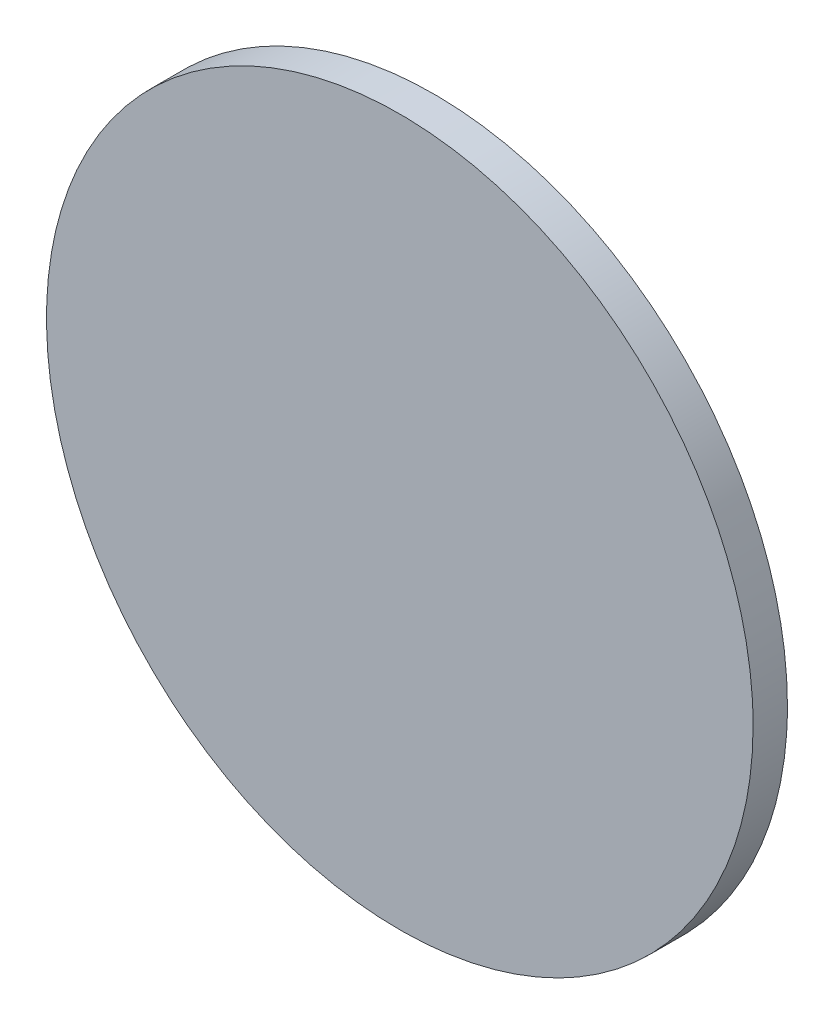
ISO-10303-21;
HEADER;
FILE_DESCRIPTION(('STEP AP214'),'2;1');
FILE_NAME('part.step','',(''),(''),'','','');
FILE_SCHEMA(('AUTOMOTIVE_DESIGN { 1 0 10303 214 1 1 1 1 }'));
ENDSEC;
DATA;
#1=APPLICATION_CONTEXT('core data for automotive mechanical design processes');
#2=APPLICATION_PROTOCOL_DEFINITION('international standard','automotive_design',2000,#1);
#3=PRODUCT_CONTEXT('',#1,'mechanical');
#4=PRODUCT('Part','Part','',(#3));
#5=PRODUCT_RELATED_PRODUCT_CATEGORY('part','',(#4));
#6=PRODUCT_DEFINITION_FORMATION('','',#4);
#7=PRODUCT_DEFINITION_CONTEXT('part definition',#1,'design');
#8=PRODUCT_DEFINITION('design','',#6,#7);
#9=PRODUCT_DEFINITION_SHAPE('','',#8);
#10=(LENGTH_UNIT() NAMED_UNIT(*) SI_UNIT(.MILLI.,.METRE.));
#11=(NAMED_UNIT(*) PLANE_ANGLE_UNIT() SI_UNIT($,.RADIAN.));
#12=(NAMED_UNIT(*) SI_UNIT($,.STERADIAN.) SOLID_ANGLE_UNIT());
#13=UNCERTAINTY_MEASURE_WITH_UNIT(LENGTH_MEASURE(1.E-05),#10,'distance_accuracy_value','');
#14=(GEOMETRIC_REPRESENTATION_CONTEXT(3) GLOBAL_UNCERTAINTY_ASSIGNED_CONTEXT((#13)) GLOBAL_UNIT_ASSIGNED_CONTEXT((#10,
#11,#12)) REPRESENTATION_CONTEXT('',''));
#15=CARTESIAN_POINT('',(0.,0.,0.));
#16=DIRECTION('',(0.,0.,1.));
#17=DIRECTION('',(1.,0.,0.));
#18=AXIS2_PLACEMENT_3D('',#15,#16,#17);
#19=CARTESIAN_POINT('',(148.667047186081,51.5235974877803,10098.6340137882));
#20=CARTESIAN_POINT('',(148.667047186081,48.1585468177496,10098.6340137882));
#21=CARTESIAN_POINT('',(148.336418508615,41.428445477688,10098.6340137882));
#22=CARTESIAN_POINT('',(146.853365662372,31.4305153000243,10098.6340137882));
#23=CARTESIAN_POINT('',(144.397485595714,21.6260924878247,10098.6340137882));
#24=CARTESIAN_POINT('',(140.992429776203,12.1095989924134,10098.6340137882));
#25=CARTESIAN_POINT('',(136.670990752775,2.97268384839567,10098.6340137882));
#26=CARTESIAN_POINT('',(131.474786345563,-5.6966594566456,10098.6340137882));
#27=CARTESIAN_POINT('',(125.453858843544,-13.8149404075378,10098.6340137882));
#28=CARTESIAN_POINT('',(118.666193069936,-21.3039755208201,10098.6340137882));
#29=CARTESIAN_POINT('',(111.177157956653,-28.0916412944284,10098.6340137882));
#30=CARTESIAN_POINT('',(103.058877005761,-34.1125687964475,10098.6340137882));
#31=CARTESIAN_POINT('',(94.3895337007198,-39.308773203659,10098.6340137882));
#32=CARTESIAN_POINT('',(85.2526185567022,-43.6302122270874,10098.6340137882));
#33=CARTESIAN_POINT('',(75.7361250612908,-47.035268046598,10098.6340137882));
#34=CARTESIAN_POINT('',(65.9317022490913,-49.4911481132562,10098.6340137882));
#35=CARTESIAN_POINT('',(55.9337720714275,-50.9742009594993,10098.6340137882));
#36=CARTESIAN_POINT('',(45.8386200613352,-51.4701439756991,10098.6340137882));
#37=CARTESIAN_POINT('',(35.7434680512428,-50.9742009594994,10098.6340137882));
#38=CARTESIAN_POINT('',(25.7455378735791,-49.4911481132562,10098.6340137882));
#39=CARTESIAN_POINT('',(15.9411150613795,-47.035268046598,10098.6340137882));
#40=CARTESIAN_POINT('',(6.42462156596818,-43.6302122270873,10098.6340137882));
#41=CARTESIAN_POINT('',(-2.71229357804946,-39.3087732036591,10098.6340137882));
#42=CARTESIAN_POINT('',(-11.3816368830908,-34.1125687964475,10098.6340137882));
#43=CARTESIAN_POINT('',(-19.499917833983,-28.0916412944284,10098.6340137882));
#44=CARTESIAN_POINT('',(-26.9889529472652,-21.3039755208201,10098.6340137882));
#45=CARTESIAN_POINT('',(-33.7766187208736,-13.8149404075378,10098.6340137882));
#46=CARTESIAN_POINT('',(-39.7975462228927,-5.6966594566456,10098.6340137882));
#47=CARTESIAN_POINT('',(-44.9937506301042,2.97268384839566,10098.6340137882));
#48=CARTESIAN_POINT('',(-49.3151896535325,12.1095989924133,10098.6340137882));
#49=CARTESIAN_POINT('',(-52.7202454730432,21.6260924878247,10098.6340137882));
#50=CARTESIAN_POINT('',(-55.1761255397013,31.4305153000242,10098.6340137882));
#51=CARTESIAN_POINT('',(-56.6591783859445,41.428445477688,10098.6340137882));
#52=CARTESIAN_POINT('',(-57.1551214021443,51.5235974877803,10098.6340137882));
#53=CARTESIAN_POINT('',(-56.6591783859445,61.6187494978727,10098.6340137882));
#54=CARTESIAN_POINT('',(-55.1761255397013,71.6166796755364,10098.6340137882));
#55=CARTESIAN_POINT('',(-52.7202454730431,81.421102487736,10098.6340137882));
#56=CARTESIAN_POINT('',(-49.3151896535326,90.9375959831473,10098.6340137882));
#57=CARTESIAN_POINT('',(-44.9937506301042,100.074511127165,10098.6340137882));
#58=CARTESIAN_POINT('',(-39.7975462228927,108.743854432206,10098.6340137882));
#59=CARTESIAN_POINT('',(-33.7766187208736,116.862135383098,10098.6340137882));
#60=CARTESIAN_POINT('',(-26.9889529472652,124.351170496381,10098.6340137882));
#61=CARTESIAN_POINT('',(-19.499917833983,131.138836269989,10098.6340137882));
#62=CARTESIAN_POINT('',(-11.3816368830907,137.159763772008,10098.6340137882));
#63=CARTESIAN_POINT('',(-2.7122935780495,142.35596817922,10098.6340137882));
#64=CARTESIAN_POINT('',(6.42462156596814,146.677407202648,10098.6340137882));
#65=CARTESIAN_POINT('',(15.9411150613794,150.082463022159,10098.6340137882));
#66=CARTESIAN_POINT('',(25.745537873579,152.538343088817,10098.6340137882));
#67=CARTESIAN_POINT('',(35.7434680512428,154.02139593506,10098.6340137882));
#68=CARTESIAN_POINT('',(45.8386200613352,154.51733895126,10098.6340137882));
#69=CARTESIAN_POINT('',(55.9337720714275,154.02139593506,10098.6340137882));
#70=CARTESIAN_POINT('',(65.9317022490913,152.538343088817,10098.6340137882));
#71=CARTESIAN_POINT('',(75.7361250612908,150.082463022159,10098.6340137882));
#72=CARTESIAN_POINT('',(85.2526185567022,146.677407202648,10098.6340137882));
#73=CARTESIAN_POINT('',(94.3895337007198,142.35596817922,10098.6340137882));
#74=CARTESIAN_POINT('',(103.058877005761,137.159763772008,10098.6340137882));
#75=CARTESIAN_POINT('',(111.177157956653,131.138836269989,10098.6340137882));
#76=CARTESIAN_POINT('',(118.666193069936,124.351170496381,10098.6340137882));
#77=CARTESIAN_POINT('',(125.453858843544,116.862135383099,10098.6340137882));
#78=CARTESIAN_POINT('',(131.474786345563,108.743854432206,10098.6340137882));
#79=CARTESIAN_POINT('',(136.670990752775,100.074511127165,10098.6340137882));
#80=CARTESIAN_POINT('',(140.992429776203,90.9375959831474,10098.6340137882));
#81=CARTESIAN_POINT('',(144.397485595714,81.421102487736,10098.6340137882));
#82=CARTESIAN_POINT('',(146.853365662372,71.6166796755365,10098.6340137882));
#83=CARTESIAN_POINT('',(148.336418508615,61.6187494978726,10098.6340137882));
#84=CARTESIAN_POINT('',(148.667047186081,54.8886481578111,10098.6340137882));
#85=CARTESIAN_POINT('',(148.667047186081,51.5235974877803,10098.6340137882));
#86=B_SPLINE_CURVE_WITH_KNOTS('',3,(#19,#20,#21,#22,#23,#24,#25,#26,#27,#28,#29,#30,#31,#32,#33,
#34,#35,#36,#37,#38,#39,#40,#41,#42,#43,#44,#45,#46,#47,#48,#49,#50,#51,#52,#53,#54,#55,#56,#57,
#58,#59,#60,#61,#62,#63,#64,#65,#66,#67,#68,#69,#70,#71,#72,#73,#74,#75,#76,#77,#78,#79,#80,#81,
#82,#83,#84,#85),.UNSPECIFIED.,.T.,.F.,(4,1,1,1,1,1,1,1,1,1,1,1,1,1,1,1,1,1,1,1,1,1,1,1,1,1,1,1,
1,1,1,1,1,1,1,1,1,1,1,1,1,1,1,1,1,1,1,1,1,1,1,1,1,1,1,1,1,1,1,1,1,1,1,1,4),(0.,0.015625,0.03125,
0.046875,0.0625000000000001,0.0781250000000001,0.0937500000000001,0.109375,0.125,0.140625,
0.15625,0.171875,0.1875,0.203125,0.21875,0.234375,0.25,0.265625,0.28125,0.296875,0.3125,
0.328125,0.34375,0.359375,0.375,0.390625,0.40625,0.421875,0.4375,0.453125,0.46875,0.484375,0.5,
0.515625,0.53125,0.546875,0.5625,0.578125,0.59375,0.609375,0.625,0.640625,0.65625,0.671875,
0.6875,0.703125,0.71875,0.734375,0.75,0.765625,0.78125,0.796875,0.8125,0.828125,0.84375,
0.859375,0.875,0.890625,0.90625,0.921875,0.9375,0.953125,0.96875,0.984375,1.),.UNSPECIFIED.);
#87=DIRECTION('',(0.,0.,1.));
#88=VECTOR('',#87,1.);
#89=SURFACE_OF_LINEAR_EXTRUSION('',#86,#88);
#90=CARTESIAN_POINT('',(148.667047186081,51.5235974877803,10098.6340137882));
#91=CARTESIAN_POINT('',(148.667047186081,53.2061228227957,10098.6340137882));
#92=CARTESIAN_POINT('',(148.625718601398,54.8886481578111,10098.6340137882));
#93=CARTESIAN_POINT('',(148.460603271096,58.2496479181574,10098.6340137882));
#94=CARTESIAN_POINT('',(148.336816525478,59.9281223434882,10098.6340137882));
#95=CARTESIAN_POINT('',(148.006983881737,63.2769693747809,10098.6340137882));
#96=CARTESIAN_POINT('',(147.800937983615,64.9473419807427,10098.6340137882));
#97=CARTESIAN_POINT('',(147.307182143602,68.2759734760875,10098.6340137882));
#98=CARTESIAN_POINT('',(147.019472201711,69.9342323654705,10098.6340137882));
#99=CARTESIAN_POINT('',(146.362983382894,73.2346245304477,10098.6340137882));
#100=CARTESIAN_POINT('',(145.994204505968,74.876757806042,10098.6340137882));
#101=CARTESIAN_POINT('',(145.176563294897,78.14096449547,10098.6340137882));
#102=CARTESIAN_POINT('',(144.727700960752,79.7630379093037,10098.6340137882));
#103=CARTESIAN_POINT('',(143.750878313057,82.9831906272389,10098.6340137882));
#104=CARTESIAN_POINT('',(143.222917999508,84.5812699313403,10098.6340137882));
#105=CARTESIAN_POINT('',(142.08926574921,87.7496157200355,10098.6340137882));
#106=CARTESIAN_POINT('',(141.483573812461,89.3198822046294,10098.6340137882));
#107=CARTESIAN_POINT('',(140.195824671972,92.4287836445342,10098.6340137882));
#108=CARTESIAN_POINT('',(139.51376746823,93.9674185998452,10098.6340137882));
#109=CARTESIAN_POINT('',(138.075021869593,97.0093905858685,10098.6340137882));
#110=CARTESIAN_POINT('',(137.318333474697,98.5127276165807,10098.6340137882));
#111=CARTESIAN_POINT('',(135.732059569591,101.480437358091,10098.6340137882));
#112=CARTESIAN_POINT('',(134.90247405938,102.944810068888,10098.6340137882));
#113=CARTESIAN_POINT('',(133.172491019017,105.831112399103,10098.6340137882));
#114=CARTESIAN_POINT('',(132.272093488864,107.25304201852,10098.6340137882));
#115=CARTESIAN_POINT('',(130.402571503992,110.050979394509,10098.6340137882));
#116=CARTESIAN_POINT('',(129.433447049273,111.426987151081,10098.6340137882));
#117=CARTESIAN_POINT('',(127.428887249567,114.129823156234,10098.6340137882));
#118=CARTESIAN_POINT('',(126.393451904581,115.456651404816,10098.6340137882));
#119=CARTESIAN_POINT('',(124.258686358643,118.057870748845,10098.6340137882));
#120=CARTESIAN_POINT('',(123.159356157692,119.332261844292,10098.6340137882));
#121=CARTESIAN_POINT('',(120.899524605319,121.825601736134,10098.6340137882));
#122=CARTESIAN_POINT('',(119.739023253897,123.044550532528,10098.6340137882));
#123=CARTESIAN_POINT('',(117.359573106082,125.424000680343,10098.6340137882));
#124=CARTESIAN_POINT('',(116.140624309688,126.584502031764,10098.6340137882));
#125=CARTESIAN_POINT('',(113.647284417847,128.844333584137,10098.6340137882));
#126=CARTESIAN_POINT('',(112.372893322399,129.943663785089,10098.6340137882));
#127=CARTESIAN_POINT('',(109.77167397837,132.078429331027,10098.6340137882));
#128=CARTESIAN_POINT('',(108.444845729789,133.113864676013,10098.6340137882));
#129=CARTESIAN_POINT('',(105.742009724636,135.118424475718,10098.6340137882));
#130=CARTESIAN_POINT('',(104.366001968064,136.087548930438,10098.6340137882));
#131=CARTESIAN_POINT('',(101.568064592075,137.95707091531,10098.6340137882));
#132=CARTESIAN_POINT('',(100.146134972658,138.857468445462,10098.6340137882));
#133=CARTESIAN_POINT('',(97.2598326424428,140.587451485825,10098.6340137882));
#134=CARTESIAN_POINT('',(95.7954599316452,141.417036996036,10098.6340137882));
#135=CARTESIAN_POINT('',(92.8277501901354,143.003310901143,10098.6340137882));
#136=CARTESIAN_POINT('',(91.3244131594231,143.759999296038,10098.6340137882));
#137=CARTESIAN_POINT('',(88.2824411733998,145.198744894675,10098.6340137882));
#138=CARTESIAN_POINT('',(86.7438062180888,145.880802098417,10098.6340137882));
#139=CARTESIAN_POINT('',(83.634904778184,147.168551238907,10098.6340137882));
#140=CARTESIAN_POINT('',(82.0646382935901,147.774243175655,10098.6340137882));
#141=CARTESIAN_POINT('',(78.8962925048949,148.907895425953,10098.6340137882));
#142=CARTESIAN_POINT('',(77.2982132007935,149.435855739503,10098.6340137882));
#143=CARTESIAN_POINT('',(74.0780604828583,150.412678387197,10098.6340137882));
#144=CARTESIAN_POINT('',(72.4559870690246,150.861540721343,10098.6340137882));
#145=CARTESIAN_POINT('',(69.1917803795966,151.679181932414,10098.6340137882));
#146=CARTESIAN_POINT('',(67.5496471040023,152.047960809339,10098.6340137882));
#147=CARTESIAN_POINT('',(64.2492549390251,152.704449628156,10098.6340137882));
#148=CARTESIAN_POINT('',(62.5909960496421,152.992159570047,10098.6340137882));
#149=CARTESIAN_POINT('',(59.2623645542974,153.48591541006,10098.6340137882));
#150=CARTESIAN_POINT('',(57.5919919483356,153.691961308183,10098.6340137882));
#151=CARTESIAN_POINT('',(54.2431449170429,154.021793951923,10098.6340137882));
#152=CARTESIAN_POINT('',(52.564670491712,154.145580697541,10098.6340137882));
#153=CARTESIAN_POINT('',(49.2036707313658,154.310696027843,10098.6340137882));
#154=CARTESIAN_POINT('',(47.5211453963504,154.352024612527,10098.6340137882));
#155=CARTESIAN_POINT('',(44.1560947263196,154.352024612527,10098.6340137882));
#156=CARTESIAN_POINT('',(42.4735693913042,154.310696027843,10098.6340137882));
#157=CARTESIAN_POINT('',(39.112569630958,154.145580697541,10098.6340137882));
#158=CARTESIAN_POINT('',(37.4340952056271,154.021793951923,10098.6340137882));
#159=CARTESIAN_POINT('',(34.0852481743344,153.691961308183,10098.6340137882));
#160=CARTESIAN_POINT('',(32.4148755683726,153.48591541006,10098.6340137882));
#161=CARTESIAN_POINT('',(29.0862440730278,152.992159570047,10098.6340137882));
#162=CARTESIAN_POINT('',(27.4279851836448,152.704449628156,10098.6340137882));
#163=CARTESIAN_POINT('',(24.1275930186676,152.047960809339,10098.6340137882));
#164=CARTESIAN_POINT('',(22.4854597430733,151.679181932413,10098.6340137882));
#165=CARTESIAN_POINT('',(19.2212530536453,150.861540721342,10098.6340137882));
#166=CARTESIAN_POINT('',(17.5991796398116,150.412678387197,10098.6340137882));
#167=CARTESIAN_POINT('',(14.3790269218764,149.435855739502,10098.6340137882));
#168=CARTESIAN_POINT('',(12.780947617775,148.907895425953,10098.6340137882));
#169=CARTESIAN_POINT('',(9.61260182907983,147.774243175655,10098.6340137882));
#170=CARTESIAN_POINT('',(8.04233534448603,147.168551238907,10098.6340137882));
#171=CARTESIAN_POINT('',(4.93343390458121,145.880802098417,10098.6340137882));
#172=CARTESIAN_POINT('',(3.3947989492702,145.198744894675,10098.6340137882));
#173=CARTESIAN_POINT('',(0.352826963246936,143.759999296038,10098.6340137882));
#174=CARTESIAN_POINT('',(-1.15051006746532,143.003310901142,10098.6340137882));
#175=CARTESIAN_POINT('',(-4.11821980897513,141.417036996036,10098.6340137882));
#176=CARTESIAN_POINT('',(-5.58259251977269,140.587451485825,10098.6340137882));
#177=CARTESIAN_POINT('',(-8.46889484998758,138.857468445462,10098.6340137882));
#178=CARTESIAN_POINT('',(-9.89082446940491,137.957070915309,10098.6340137882));
#179=CARTESIAN_POINT('',(-12.6887618453938,136.087548930438,10098.6340137882));
#180=CARTESIAN_POINT('',(-14.0647696019654,135.118424475718,10098.6340137882));
#181=CARTESIAN_POINT('',(-16.7676056071186,133.113864676012,10098.6340137882));
#182=CARTESIAN_POINT('',(-18.0944338557002,132.078429331026,10098.6340137882));
#183=CARTESIAN_POINT('',(-20.6956531997293,129.943663785088,10098.6340137882));
#184=CARTESIAN_POINT('',(-21.9700442951768,128.844333584137,10098.6340137882));
#185=CARTESIAN_POINT('',(-24.4633841870182,126.584502031764,10098.6340137882));
#186=CARTESIAN_POINT('',(-25.6823329834121,125.424000680343,10098.6340137882));
#187=CARTESIAN_POINT('',(-28.0617831312272,123.044550532527,10098.6340137882));
#188=CARTESIAN_POINT('',(-29.2222844826484,121.825601736133,10098.6340137882));
#189=CARTESIAN_POINT('',(-31.4821160350214,119.332261844292,10098.6340137882));
#190=CARTESIAN_POINT('',(-32.5814462359732,118.057870748845,10098.6340137882));
#191=CARTESIAN_POINT('',(-34.7162117819111,115.456651404815,10098.6340137882));
#192=CARTESIAN_POINT('',(-35.7516471268971,114.129823156234,10098.6340137882));
#193=CARTESIAN_POINT('',(-37.7562069266027,111.426987151081,10098.6340137882));
#194=CARTESIAN_POINT('',(-38.7253313813223,110.050979394509,10098.6340137882));
#195=CARTESIAN_POINT('',(-40.5948533661941,107.25304201852,10098.6340137882));
#196=CARTESIAN_POINT('',(-41.4952508963463,105.831112399103,10098.6340137882));
#197=CARTESIAN_POINT('',(-43.2252339367095,102.944810068888,10098.6340137882));
#198=CARTESIAN_POINT('',(-44.0548194469204,101.48043735809,10098.6340137882));
#199=CARTESIAN_POINT('',(-45.6410933520271,98.5127276165805,10098.6340137882));
#200=CARTESIAN_POINT('',(-46.3977817469228,97.0093905858683,10098.6340137882));
#201=CARTESIAN_POINT('',(-47.8365273455599,93.967418599845,10098.6340137882));
#202=CARTESIAN_POINT('',(-48.5185845493014,92.428783644534,10098.6340137882));
#203=CARTESIAN_POINT('',(-49.8063336897912,89.3198822046292,10098.6340137882));
#204=CARTESIAN_POINT('',(-50.4120256265396,87.7496157200353,10098.6340137882));
#205=CARTESIAN_POINT('',(-51.5456778768375,84.5812699313401,10098.6340137882));
#206=CARTESIAN_POINT('',(-52.0736381903871,82.9831906272387,10098.6340137882));
#207=CARTESIAN_POINT('',(-53.0504608380819,79.7630379093036,10098.6340137882));
#208=CARTESIAN_POINT('',(-53.4993231722271,78.1409644954698,10098.6340137882));
#209=CARTESIAN_POINT('',(-54.316964383298,74.8767578060418,10098.6340137882));
#210=CARTESIAN_POINT('',(-54.6857432602238,73.2346245304475,10098.6340137882));
#211=CARTESIAN_POINT('',(-55.3422320790406,69.9342323654703,10098.6340137882));
#212=CARTESIAN_POINT('',(-55.6299420209318,68.2759734760874,10098.6340137882));
#213=CARTESIAN_POINT('',(-56.123697860945,64.9473419807426,10098.6340137882));
#214=CARTESIAN_POINT('',(-56.329743759067,63.2769693747808,10098.6340137882));
#215=CARTESIAN_POINT('',(-56.6595764028075,59.9281223434881,10098.6340137882));
#216=CARTESIAN_POINT('',(-56.783363148426,58.2496479181572,10098.6340137882));
#217=CARTESIAN_POINT('',(-56.9484784787277,54.888648157811,10098.6340137882));
#218=CARTESIAN_POINT('',(-56.989807063411,53.2061228227956,10098.6340137882));
#219=CARTESIAN_POINT('',(-56.989807063411,49.8410721527648,10098.6340137882));
#220=CARTESIAN_POINT('',(-56.9484784787277,48.1585468177494,10098.6340137882));
#221=CARTESIAN_POINT('',(-56.7833631484259,44.7975470574031,10098.6340137882));
#222=CARTESIAN_POINT('',(-56.6595764028075,43.1190726320723,10098.6340137882));
#223=CARTESIAN_POINT('',(-56.329743759067,39.7702256007796,10098.6340137882));
#224=CARTESIAN_POINT('',(-56.1236978609449,38.0998529948178,10098.6340137882));
#225=CARTESIAN_POINT('',(-55.6299420209317,34.771221499473,10098.6340137882));
#226=CARTESIAN_POINT('',(-55.3422320790406,33.1129626100901,10098.6340137882));
#227=CARTESIAN_POINT('',(-54.6857432602237,29.8125704451129,10098.6340137882));
#228=CARTESIAN_POINT('',(-54.3169643832979,28.1704371695186,10098.6340137882));
#229=CARTESIAN_POINT('',(-53.499323172227,24.9062304800906,10098.6340137882));
#230=CARTESIAN_POINT('',(-53.0504608380818,23.2841570662568,10098.6340137882));
#231=CARTESIAN_POINT('',(-52.073638190387,20.0640043483217,10098.6340137882));
#232=CARTESIAN_POINT('',(-51.5456778768374,18.4659250442203,10098.6340137882));
#233=CARTESIAN_POINT('',(-50.4120256265394,15.297579255525,10098.6340137882));
#234=CARTESIAN_POINT('',(-49.8063336897911,13.7273127709312,10098.6340137882));
#235=CARTESIAN_POINT('',(-48.5185845493013,10.6184113310264,10098.6340137882));
#236=CARTESIAN_POINT('',(-47.8365273455598,9.07977637571536,10098.6340137882));
#237=CARTESIAN_POINT('',(-46.3977817469226,6.03780438969208,10098.6340137882));
#238=CARTESIAN_POINT('',(-45.6410933520269,4.53446735897982,10098.6340137882));
#239=CARTESIAN_POINT('',(-44.0548194469203,1.56675761747,10098.6340137882));
#240=CARTESIAN_POINT('',(-43.2252339367093,0.102384906672438,10098.6340137882));
#241=CARTESIAN_POINT('',(-41.4952508963461,-2.78391742354245,10098.6340137882));
#242=CARTESIAN_POINT('',(-40.5948533661939,-4.20584704295978,10098.6340137882));
#243=CARTESIAN_POINT('',(-38.7253313813221,-7.00378441894869,10098.6340137882));
#244=CARTESIAN_POINT('',(-37.7562069266025,-8.37979217552027,10098.6340137882));
#245=CARTESIAN_POINT('',(-35.7516471268969,-11.0826281806735,10098.6340137882));
#246=CARTESIAN_POINT('',(-34.7162117819109,-12.4094564292551,10098.6340137882));
#247=CARTESIAN_POINT('',(-32.581446235973,-15.0106757732842,10098.6340137882));
#248=CARTESIAN_POINT('',(-31.4821160350211,-16.2850668687316,10098.6340137882));
#249=CARTESIAN_POINT('',(-29.2222844826481,-18.778406760573,10098.6340137882));
#250=CARTESIAN_POINT('',(-28.061783131227,-19.997355556967,10098.6340137882));
#251=CARTESIAN_POINT('',(-25.6823329834119,-22.3768057047821,10098.6340137882));
#252=CARTESIAN_POINT('',(-24.4633841870179,-23.5373070562032,10098.6340137882));
#253=CARTESIAN_POINT('',(-21.9700442951765,-25.7971386085762,10098.6340137882));
#254=CARTESIAN_POINT('',(-20.6956531997291,-26.896468809528,10098.6340137882));
#255=CARTESIAN_POINT('',(-18.0944338557,-29.0312343554659,10098.6340137882));
#256=CARTESIAN_POINT('',(-16.7676056071184,-30.066669700452,10098.6340137882));
#257=CARTESIAN_POINT('',(-14.0647696019652,-32.0712295001576,10098.6340137882));
#258=CARTESIAN_POINT('',(-12.6887618453936,-33.0403539548771,10098.6340137882));
#259=CARTESIAN_POINT('',(-9.89082446940467,-34.9098759397489,10098.6340137882));
#260=CARTESIAN_POINT('',(-8.46889484998733,-35.8102734699011,10098.6340137882));
#261=CARTESIAN_POINT('',(-5.58259251977243,-37.5402565102643,10098.6340137882));
#262=CARTESIAN_POINT('',(-4.11821980897487,-38.3698420204752,10098.6340137882));
#263=CARTESIAN_POINT('',(-1.15051006746505,-39.9561159255819,10098.6340137882));
#264=CARTESIAN_POINT('',(0.352826963247215,-40.7128043204776,10098.6340137882));
#265=CARTESIAN_POINT('',(3.39479894927049,-42.1515499191147,10098.6340137882));
#266=CARTESIAN_POINT('',(4.9334339045815,-42.8336071228562,10098.6340137882));
#267=CARTESIAN_POINT('',(8.04233534448633,-44.121356263346,10098.6340137882));
#268=CARTESIAN_POINT('',(9.61260182908015,-44.7270482000944,10098.6340137882));
#269=CARTESIAN_POINT('',(12.7809476177754,-45.8607004503923,10098.6340137882));
#270=CARTESIAN_POINT('',(14.3790269218768,-46.3886607639419,10098.6340137882));
#271=CARTESIAN_POINT('',(17.5991796398119,-47.3654834116367,10098.6340137882));
#272=CARTESIAN_POINT('',(19.2212530536457,-47.8143457457819,10098.6340137882));
#273=CARTESIAN_POINT('',(22.4854597430737,-48.6319869568528,10098.6340137882));
#274=CARTESIAN_POINT('',(24.127593018668,-49.0007658337786,10098.6340137882));
#275=CARTESIAN_POINT('',(27.4279851836452,-49.6572546525955,10098.6340137882));
#276=CARTESIAN_POINT('',(29.0862440730281,-49.9449645944866,10098.6340137882));
#277=CARTESIAN_POINT('',(32.4148755683729,-50.4387204344998,10098.6340137882));
#278=CARTESIAN_POINT('',(34.0852481743347,-50.6447663326219,10098.6340137882));
#279=CARTESIAN_POINT('',(37.4340952056274,-50.9745989763624,10098.6340137882));
#280=CARTESIAN_POINT('',(39.1125696309583,-51.0983857219808,10098.6340137882));
#281=CARTESIAN_POINT('',(42.4735693913045,-51.2635010522825,10098.6340137882));
#282=CARTESIAN_POINT('',(44.1560947263199,-51.3048296369659,10098.6340137882));
#283=CARTESIAN_POINT('',(47.5211453963507,-51.3048296369659,10098.6340137882));
#284=CARTESIAN_POINT('',(49.2036707313661,-51.2635010522825,10098.6340137882));
#285=CARTESIAN_POINT('',(52.5646704917123,-51.0983857219808,10098.6340137882));
#286=CARTESIAN_POINT('',(54.2431449170432,-50.9745989763624,10098.6340137882));
#287=CARTESIAN_POINT('',(57.5919919483359,-50.6447663326219,10098.6340137882));
#288=CARTESIAN_POINT('',(59.2623645542977,-50.4387204344998,10098.6340137882));
#289=CARTESIAN_POINT('',(62.5909960496424,-49.9449645944866,10098.6340137882));
#290=CARTESIAN_POINT('',(64.2492549390254,-49.6572546525954,10098.6340137882));
#291=CARTESIAN_POINT('',(67.5496471040026,-49.0007658337785,10098.6340137882));
#292=CARTESIAN_POINT('',(69.1917803795969,-48.6319869568528,10098.6340137882));
#293=CARTESIAN_POINT('',(72.4559870690249,-47.8143457457818,10098.6340137882));
#294=CARTESIAN_POINT('',(74.0780604828586,-47.3654834116366,10098.6340137882));
#295=CARTESIAN_POINT('',(77.2982132007938,-46.3886607639418,10098.6340137882));
#296=CARTESIAN_POINT('',(78.8962925048952,-45.8607004503923,10098.6340137882));
#297=CARTESIAN_POINT('',(82.0646382935904,-44.7270482000943,10098.6340137882));
#298=CARTESIAN_POINT('',(83.6349047781842,-44.121356263346,10098.6340137882));
#299=CARTESIAN_POINT('',(86.743806218089,-42.8336071228561,10098.6340137882));
#300=CARTESIAN_POINT('',(88.2824411734,-42.1515499191147,10098.6340137882));
#301=CARTESIAN_POINT('',(91.3244131594233,-40.7128043204775,10098.6340137882));
#302=CARTESIAN_POINT('',(92.8277501901356,-39.9561159255818,10098.6340137882));
#303=CARTESIAN_POINT('',(95.7954599316454,-38.3698420204751,10098.6340137882));
#304=CARTESIAN_POINT('',(97.259832642443,-37.5402565102642,10098.6340137882));
#305=CARTESIAN_POINT('',(100.146134972658,-35.810273469901,10098.6340137882));
#306=CARTESIAN_POINT('',(101.568064592075,-34.9098759397488,10098.6340137882));
#307=CARTESIAN_POINT('',(104.366001968064,-33.040353954877,10098.6340137882));
#308=CARTESIAN_POINT('',(105.742009724636,-32.0712295001575,10098.6340137882));
#309=CARTESIAN_POINT('',(108.444845729789,-30.0666697004518,10098.6340137882));
#310=CARTESIAN_POINT('',(109.771673978371,-29.0312343554658,10098.6340137882));
#311=CARTESIAN_POINT('',(112.3728933224,-26.8964688095279,10098.6340137882));
#312=CARTESIAN_POINT('',(113.647284417847,-25.797138608576,10098.6340137882));
#313=CARTESIAN_POINT('',(116.140624309688,-23.5373070562031,10098.6340137882));
#314=CARTESIAN_POINT('',(117.359573106082,-22.3768057047819,10098.6340137882));
#315=CARTESIAN_POINT('',(119.739023253898,-19.9973555569668,10098.6340137882));
#316=CARTESIAN_POINT('',(120.899524605319,-18.7784067605729,10098.6340137882));
#317=CARTESIAN_POINT('',(123.159356157692,-16.2850668687314,10098.6340137882));
#318=CARTESIAN_POINT('',(124.258686358643,-15.010675773284,10098.6340137882));
#319=CARTESIAN_POINT('',(126.393451904581,-12.4094564292549,10098.6340137882));
#320=CARTESIAN_POINT('',(127.428887249567,-11.0826281806733,10098.6340137882));
#321=CARTESIAN_POINT('',(129.433447049273,-8.37979217552009,10098.6340137882));
#322=CARTESIAN_POINT('',(130.402571503993,-7.0037844189485,10098.6340137882));
#323=CARTESIAN_POINT('',(132.272093488864,-4.20584704295959,10098.6340137882));
#324=CARTESIAN_POINT('',(133.172491019017,-2.78391742354225,10098.6340137882));
#325=CARTESIAN_POINT('',(134.90247405938,0.102384906672635,10098.6340137882));
#326=CARTESIAN_POINT('',(135.732059569591,1.56675761747019,10098.6340137882));
#327=CARTESIAN_POINT('',(137.318333474697,4.53446735898002,10098.6340137882));
#328=CARTESIAN_POINT('',(138.075021869593,6.03780438969229,10098.6340137882));
#329=CARTESIAN_POINT('',(139.51376746823,9.07977637571557,10098.6340137882));
#330=CARTESIAN_POINT('',(140.195824671972,10.6184113310266,10098.6340137882));
#331=CARTESIAN_POINT('',(141.483573812462,13.7273127709314,10098.6340137882));
#332=CARTESIAN_POINT('',(142.08926574921,15.2975792555252,10098.6340137882));
#333=CARTESIAN_POINT('',(143.222917999508,18.4659250442204,10098.6340137882));
#334=CARTESIAN_POINT('',(143.750878313057,20.0640043483218,10098.6340137882));
#335=CARTESIAN_POINT('',(144.727700960752,23.284157066257,10098.6340137882));
#336=CARTESIAN_POINT('',(145.176563294897,24.9062304800907,10098.6340137882));
#337=CARTESIAN_POINT('',(145.994204505968,28.1704371695188,10098.6340137882));
#338=CARTESIAN_POINT('',(146.362983382894,29.812570445113,10098.6340137882));
#339=CARTESIAN_POINT('',(147.019472201711,33.1129626100902,10098.6340137882));
#340=CARTESIAN_POINT('',(147.307182143602,34.7712214994732,10098.6340137882));
#341=CARTESIAN_POINT('',(147.800937983615,38.0998529948179,10098.6340137882));
#342=CARTESIAN_POINT('',(148.006983881737,39.7702256007798,10098.6340137882));
#343=CARTESIAN_POINT('',(148.336816525478,43.1190726320724,10098.6340137882));
#344=CARTESIAN_POINT('',(148.460603271096,44.7975470574033,10098.6340137882));
#345=CARTESIAN_POINT('',(148.625718601398,48.1585468177496,10098.6340137882));
#346=CARTESIAN_POINT('',(148.667047186081,49.841072152765,10098.6340137882));
#347=CARTESIAN_POINT('',(148.667047186081,51.5235974877803,10098.6340137882));
#348=B_SPLINE_CURVE_WITH_KNOTS('',3,(#90,#91,#92,#93,#94,#95,#96,#97,#98,#99,#100,#101,#102,
#103,#104,#105,#106,#107,#108,#109,#110,#111,#112,#113,#114,#115,#116,#117,#118,#119,#120,#121,
#122,#123,#124,#125,#126,#127,#128,#129,#130,#131,#132,#133,#134,#135,#136,#137,#138,#139,#140,
#141,#142,#143,#144,#145,#146,#147,#148,#149,#150,#151,#152,#153,#154,#155,#156,#157,#158,#159,
#160,#161,#162,#163,#164,#165,#166,#167,#168,#169,#170,#171,#172,#173,#174,#175,#176,#177,#178,
#179,#180,#181,#182,#183,#184,#185,#186,#187,#188,#189,#190,#191,#192,#193,#194,#195,#196,#197,
#198,#199,#200,#201,#202,#203,#204,#205,#206,#207,#208,#209,#210,#211,#212,#213,#214,#215,#216,
#217,#218,#219,#220,#221,#222,#223,#224,#225,#226,#227,#228,#229,#230,#231,#232,#233,#234,#235,
#236,#237,#238,#239,#240,#241,#242,#243,#244,#245,#246,#247,#248,#249,#250,#251,#252,#253,#254,
#255,#256,#257,#258,#259,#260,#261,#262,#263,#264,#265,#266,#267,#268,#269,#270,#271,#272,#273,
#274,#275,#276,#277,#278,#279,#280,#281,#282,#283,#284,#285,#286,#287,#288,#289,#290,#291,#292,
#293,#294,#295,#296,#297,#298,#299,#300,#301,#302,#303,#304,#305,#306,#307,#308,#309,#310,#311,
#312,#313,#314,#315,#316,#317,#318,#319,#320,#321,#322,#323,#324,#325,#326,#327,#328,#329,#330,
#331,#332,#333,#334,#335,#336,#337,#338,#339,#340,#341,#342,#343,#344,#345,#346,#347),
.UNSPECIFIED.,.F.,.F.,(4,2,2,2,2,2,2,2,2,2,2,2,2,2,2,2,2,2,2,2,2,2,2,2,2,2,2,2,2,2,2,2,2,2,2,2,
2,2,2,2,2,2,2,2,2,2,2,2,2,2,2,2,2,2,2,2,2,2,2,2,2,2,2,2,2,2,2,2,2,2,2,2,2,2,2,2,2,2,2,2,2,2,2,2,
2,2,2,2,2,2,2,2,2,2,2,2,2,2,2,2,2,2,2,2,2,2,2,2,2,2,2,2,2,2,2,2,2,2,2,2,2,2,2,2,2,2,2,2,4),(0.,
5.0470712455404,10.0941424910808,15.1412137366213,20.1882849821617,25.2353562277021,
30.2824274732426,35.329498718783,40.3765699643235,45.4236412098639,50.4707124554043,
55.5177837009447,60.5648549464852,65.6119261920256,70.658997437566,75.7060686831065,
80.7531399286469,85.8002111741874,90.8472824197278,95.8943536652682,100.941424910809,
105.988496156349,111.035567401889,116.08263864743,121.12970989297,126.176781138511,
131.223852384051,136.270923629592,141.317994875132,146.365066120673,151.412137366213,
156.459208611753,161.506279857294,166.553351102834,171.600422348375,176.647493593915,
181.694564839456,186.741636084996,191.788707330536,196.835778576077,201.882849821617,
206.929921067158,211.976992312698,217.024063558238,222.071134803779,227.118206049319,
232.16527729486,237.2123485404,242.259419785941,247.306491031481,252.353562277021,
257.400633522562,262.447704768102,267.494776013643,272.541847259183,277.588918504724,
282.635989750264,287.683060995805,292.730132241345,297.777203486885,302.824274732426,
307.871345977966,312.918417223507,317.965488469047,323.012559714588,328.059630960128,
333.106702205668,338.153773451209,343.200844696749,348.24791594229,353.29498718783,
358.342058433371,363.389129678911,368.436200924451,373.483272169992,378.530343415532,
383.577414661073,388.624485906613,393.671557152154,398.718628397694,403.765699643234,
408.812770888775,413.859842134315,418.906913379856,423.953984625396,429.001055870937,
434.048127116477,439.095198362017,444.142269607558,449.189340853098,454.236412098639,
459.283483344179,464.33055458972,469.37762583526,474.424697080801,479.471768326341,
484.518839571881,489.565910817422,494.612982062962,499.660053308503,504.707124554043,
509.754195799583,514.801267045124,519.848338290664,524.895409536205,529.942480781745,
534.989552027286,540.036623272826,545.083694518366,550.130765763907,555.177837009447,
560.224908254987,565.271979500528,570.319050746068,575.366121991609,580.413193237149,
585.460264482689,590.50733572823,595.55440697377,600.601478219311,605.648549464851,
610.695620710391,615.742691955932,620.789763201472,625.836834447013,630.883905692553,
635.930976938093,640.978048183634,646.025119429174),.UNSPECIFIED.);
#349=CARTESIAN_POINT('',(148.667047186081,51.5235974877803,10098.6340137882));
#350=VERTEX_POINT('',#349);
#351=EDGE_CURVE('E9',#350,#350,#348,.F.);
#352=ORIENTED_EDGE('',*,*,#351,.F.);
#353=EDGE_LOOP('',(#352));
#354=FACE_BOUND('',#353,.T.);
#355=CARTESIAN_POINT('',(148.667047186081,51.5235974877803,10108.6340137882));
#356=CARTESIAN_POINT('',(148.667047186081,48.1585468177496,10108.6340137882));
#357=CARTESIAN_POINT('',(148.336418508615,41.428445477688,10108.6340137882));
#358=CARTESIAN_POINT('',(146.853365662372,31.4305153000243,10108.6340137882));
#359=CARTESIAN_POINT('',(144.397485595714,21.6260924878247,10108.6340137882));
#360=CARTESIAN_POINT('',(140.992429776203,12.1095989924134,10108.6340137882));
#361=CARTESIAN_POINT('',(136.670990752775,2.97268384839567,10108.6340137882));
#362=CARTESIAN_POINT('',(131.474786345563,-5.6966594566456,10108.6340137882));
#363=CARTESIAN_POINT('',(125.453858843544,-13.8149404075378,10108.6340137882));
#364=CARTESIAN_POINT('',(118.666193069936,-21.3039755208201,10108.6340137882));
#365=CARTESIAN_POINT('',(111.177157956653,-28.0916412944284,10108.6340137882));
#366=CARTESIAN_POINT('',(103.058877005761,-34.1125687964475,10108.6340137882));
#367=CARTESIAN_POINT('',(94.3895337007198,-39.308773203659,10108.6340137882));
#368=CARTESIAN_POINT('',(85.2526185567022,-43.6302122270874,10108.6340137882));
#369=CARTESIAN_POINT('',(75.7361250612908,-47.035268046598,10108.6340137882));
#370=CARTESIAN_POINT('',(65.9317022490913,-49.4911481132562,10108.6340137882));
#371=CARTESIAN_POINT('',(55.9337720714275,-50.9742009594993,10108.6340137882));
#372=CARTESIAN_POINT('',(45.8386200613352,-51.4701439756991,10108.6340137882));
#373=CARTESIAN_POINT('',(35.7434680512428,-50.9742009594994,10108.6340137882));
#374=CARTESIAN_POINT('',(25.7455378735791,-49.4911481132562,10108.6340137882));
#375=CARTESIAN_POINT('',(15.9411150613795,-47.035268046598,10108.6340137882));
#376=CARTESIAN_POINT('',(6.42462156596818,-43.6302122270873,10108.6340137882));
#377=CARTESIAN_POINT('',(-2.71229357804946,-39.3087732036591,10108.6340137882));
#378=CARTESIAN_POINT('',(-11.3816368830908,-34.1125687964475,10108.6340137882));
#379=CARTESIAN_POINT('',(-19.499917833983,-28.0916412944284,10108.6340137882));
#380=CARTESIAN_POINT('',(-26.9889529472652,-21.3039755208201,10108.6340137882));
#381=CARTESIAN_POINT('',(-33.7766187208736,-13.8149404075378,10108.6340137882));
#382=CARTESIAN_POINT('',(-39.7975462228927,-5.6966594566456,10108.6340137882));
#383=CARTESIAN_POINT('',(-44.9937506301042,2.97268384839566,10108.6340137882));
#384=CARTESIAN_POINT('',(-49.3151896535325,12.1095989924133,10108.6340137882));
#385=CARTESIAN_POINT('',(-52.7202454730432,21.6260924878247,10108.6340137882));
#386=CARTESIAN_POINT('',(-55.1761255397013,31.4305153000242,10108.6340137882));
#387=CARTESIAN_POINT('',(-56.6591783859445,41.428445477688,10108.6340137882));
#388=CARTESIAN_POINT('',(-57.1551214021443,51.5235974877803,10108.6340137882));
#389=CARTESIAN_POINT('',(-56.6591783859445,61.6187494978727,10108.6340137882));
#390=CARTESIAN_POINT('',(-55.1761255397013,71.6166796755364,10108.6340137882));
#391=CARTESIAN_POINT('',(-52.7202454730431,81.421102487736,10108.6340137882));
#392=CARTESIAN_POINT('',(-49.3151896535326,90.9375959831473,10108.6340137882));
#393=CARTESIAN_POINT('',(-44.9937506301042,100.074511127165,10108.6340137882));
#394=CARTESIAN_POINT('',(-39.7975462228927,108.743854432206,10108.6340137882));
#395=CARTESIAN_POINT('',(-33.7766187208736,116.862135383098,10108.6340137882));
#396=CARTESIAN_POINT('',(-26.9889529472652,124.351170496381,10108.6340137882));
#397=CARTESIAN_POINT('',(-19.499917833983,131.138836269989,10108.6340137882));
#398=CARTESIAN_POINT('',(-11.3816368830907,137.159763772008,10108.6340137882));
#399=CARTESIAN_POINT('',(-2.7122935780495,142.35596817922,10108.6340137882));
#400=CARTESIAN_POINT('',(6.42462156596814,146.677407202648,10108.6340137882));
#401=CARTESIAN_POINT('',(15.9411150613794,150.082463022159,10108.6340137882));
#402=CARTESIAN_POINT('',(25.745537873579,152.538343088817,10108.6340137882));
#403=CARTESIAN_POINT('',(35.7434680512428,154.02139593506,10108.6340137882));
#404=CARTESIAN_POINT('',(45.8386200613352,154.51733895126,10108.6340137882));
#405=CARTESIAN_POINT('',(55.9337720714275,154.02139593506,10108.6340137882));
#406=CARTESIAN_POINT('',(65.9317022490913,152.538343088817,10108.6340137882));
#407=CARTESIAN_POINT('',(75.7361250612908,150.082463022159,10108.6340137882));
#408=CARTESIAN_POINT('',(85.2526185567022,146.677407202648,10108.6340137882));
#409=CARTESIAN_POINT('',(94.3895337007198,142.35596817922,10108.6340137882));
#410=CARTESIAN_POINT('',(103.058877005761,137.159763772008,10108.6340137882));
#411=CARTESIAN_POINT('',(111.177157956653,131.138836269989,10108.6340137882));
#412=CARTESIAN_POINT('',(118.666193069936,124.351170496381,10108.6340137882));
#413=CARTESIAN_POINT('',(125.453858843544,116.862135383099,10108.6340137882));
#414=CARTESIAN_POINT('',(131.474786345563,108.743854432206,10108.6340137882));
#415=CARTESIAN_POINT('',(136.670990752775,100.074511127165,10108.6340137882));
#416=CARTESIAN_POINT('',(140.992429776203,90.9375959831474,10108.6340137882));
#417=CARTESIAN_POINT('',(144.397485595714,81.421102487736,10108.6340137882));
#418=CARTESIAN_POINT('',(146.853365662372,71.6166796755365,10108.6340137882));
#419=CARTESIAN_POINT('',(148.336418508615,61.6187494978726,10108.6340137882));
#420=CARTESIAN_POINT('',(148.667047186081,54.8886481578111,10108.6340137882));
#421=CARTESIAN_POINT('',(148.667047186081,51.5235974877803,10108.6340137882));
#422=B_SPLINE_CURVE_WITH_KNOTS('',3,(#355,#356,#357,#358,#359,#360,#361,#362,#363,#364,#365,
#366,#367,#368,#369,#370,#371,#372,#373,#374,#375,#376,#377,#378,#379,#380,#381,#382,#383,#384,
#385,#386,#387,#388,#389,#390,#391,#392,#393,#394,#395,#396,#397,#398,#399,#400,#401,#402,#403,
#404,#405,#406,#407,#408,#409,#410,#411,#412,#413,#414,#415,#416,#417,#418,#419,#420,#421),
.UNSPECIFIED.,.T.,.F.,(4,1,1,1,1,1,1,1,1,1,1,1,1,1,1,1,1,1,1,1,1,1,1,1,1,1,1,1,1,1,1,1,1,1,1,1,
1,1,1,1,1,1,1,1,1,1,1,1,1,1,1,1,1,1,1,1,1,1,1,1,1,1,1,1,4),(0.,0.015625,0.03125,0.046875,
0.0625000000000001,0.0781250000000001,0.0937500000000001,0.109375,0.125,0.140625,0.15625,
0.171875,0.1875,0.203125,0.21875,0.234375,0.25,0.265625,0.28125,0.296875,0.3125,0.328125,
0.34375,0.359375,0.375,0.390625,0.40625,0.421875,0.4375,0.453125,0.46875,0.484375,0.5,0.515625,
0.53125,0.546875,0.5625,0.578125,0.59375,0.609375,0.625,0.640625,0.65625,0.671875,0.6875,
0.703125,0.71875,0.734375,0.75,0.765625,0.78125,0.796875,0.8125,0.828125,0.84375,0.859375,0.875,
0.890625,0.90625,0.921875,0.9375,0.953125,0.96875,0.984375,1.),.UNSPECIFIED.);
#423=CARTESIAN_POINT('',(148.667047186081,51.5235974877803,10108.6340137882));
#424=VERTEX_POINT('',#423);
#425=EDGE_CURVE('E24',#424,#424,#422,.T.);
#426=ORIENTED_EDGE('',*,*,#425,.T.);
#427=EDGE_LOOP('',(#426));
#428=FACE_BOUND('',#427,.T.);
#429=ADVANCED_FACE('F14',(#354,#428),#89,.F.);
#430=CARTESIAN_POINT('',(-54.1613799386648,51.5235974877803,10098.6340137882));
#431=DIRECTION('',(0.,0.,1.));
#432=DIRECTION('',(0.,-1.,0.));
#433=AXIS2_PLACEMENT_3D('',#430,#431,#432);
#434=PLANE('',#433);
#435=ORIENTED_EDGE('',*,*,#351,.T.);
#436=EDGE_LOOP('',(#435));
#437=FACE_BOUND('',#436,.T.);
#438=ADVANCED_FACE('F59',(#437),#434,.F.);
#439=CARTESIAN_POINT('',(-54.1613799386648,51.5235974877803,10108.6340137882));
#440=DIRECTION('',(0.,0.,1.));
#441=DIRECTION('',(0.,-1.,0.));
#442=AXIS2_PLACEMENT_3D('',#439,#440,#441);
#443=PLANE('',#442);
#444=ORIENTED_EDGE('',*,*,#425,.F.);
#445=EDGE_LOOP('',(#444));
#446=FACE_BOUND('',#445,.T.);
#447=ADVANCED_FACE('F67',(#446),#443,.T.);
#448=CLOSED_SHELL('',(#429,#438,#447));
#449=MANIFOLD_SOLID_BREP('B1',#448);
#450=ADVANCED_BREP_SHAPE_REPRESENTATION('',(#18,#449),#14);
#451=SHAPE_DEFINITION_REPRESENTATION(#9,#450);
ENDSEC;
END-ISO-10303-21;
